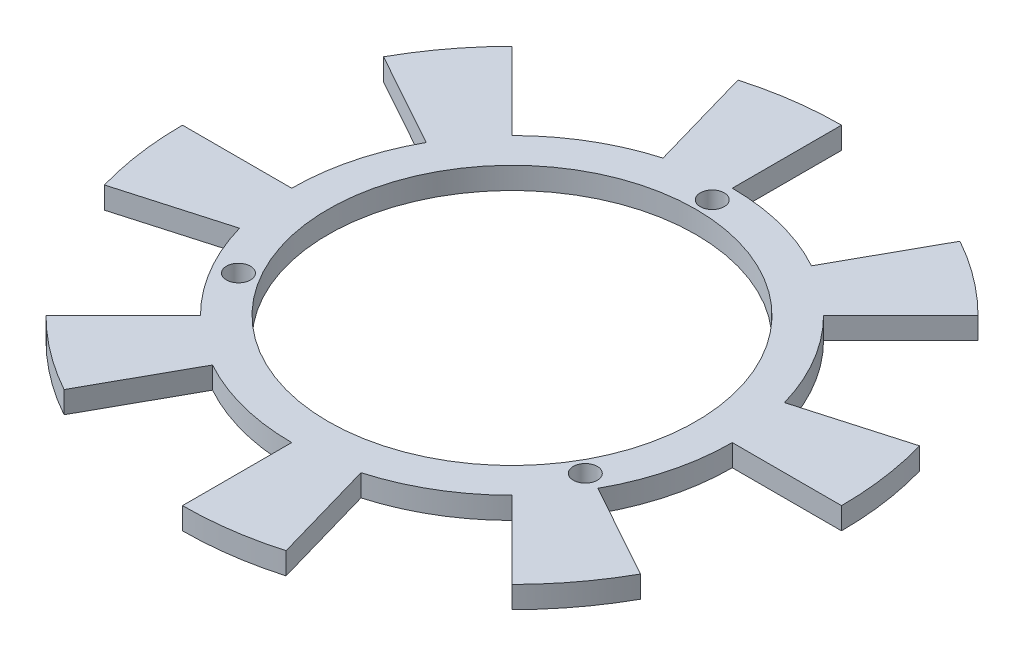
ISO-10303-21;
HEADER;
FILE_DESCRIPTION(('STEP AP214'),'2;1');
FILE_NAME('part.step','',(''),(''),'','','');
FILE_SCHEMA(('AUTOMOTIVE_DESIGN { 1 0 10303 214 1 1 1 1 }'));
ENDSEC;
DATA;
#1=APPLICATION_CONTEXT('core data for automotive mechanical design processes');
#2=APPLICATION_PROTOCOL_DEFINITION('international standard','automotive_design',2000,#1);
#3=PRODUCT_CONTEXT('',#1,'mechanical');
#4=PRODUCT('Part','Part','',(#3));
#5=PRODUCT_RELATED_PRODUCT_CATEGORY('part','',(#4));
#6=PRODUCT_DEFINITION_FORMATION('','',#4);
#7=PRODUCT_DEFINITION_CONTEXT('part definition',#1,'design');
#8=PRODUCT_DEFINITION('design','',#6,#7);
#9=PRODUCT_DEFINITION_SHAPE('','',#8);
#10=(LENGTH_UNIT() NAMED_UNIT(*) SI_UNIT(.MILLI.,.METRE.));
#11=(NAMED_UNIT(*) PLANE_ANGLE_UNIT() SI_UNIT($,.RADIAN.));
#12=(NAMED_UNIT(*) SI_UNIT($,.STERADIAN.) SOLID_ANGLE_UNIT());
#13=UNCERTAINTY_MEASURE_WITH_UNIT(LENGTH_MEASURE(1.E-05),#10,'distance_accuracy_value','');
#14=(GEOMETRIC_REPRESENTATION_CONTEXT(3) GLOBAL_UNCERTAINTY_ASSIGNED_CONTEXT((#13)) GLOBAL_UNIT_ASSIGNED_CONTEXT((#10,
#11,#12)) REPRESENTATION_CONTEXT('',''));
#15=CARTESIAN_POINT('',(0.,0.,0.));
#16=DIRECTION('',(0.,0.,1.));
#17=DIRECTION('',(1.,0.,0.));
#18=AXIS2_PLACEMENT_3D('',#15,#16,#17);
#19=CARTESIAN_POINT('',(0.,-3.,0.));
#20=DIRECTION('',(0.,1.,0.));
#21=DIRECTION('',(0.,0.,1.));
#22=AXIS2_PLACEMENT_3D('',#19,#20,#21);
#23=CYLINDRICAL_SURFACE('',#22,30.25);
#24=DIRECTION('',(0.,-1.,0.));
#25=VECTOR('',#24,1.);
#26=CARTESIAN_POINT('',(-14.6654910124517,0.,26.4572461409667));
#27=LINE('',#26,#25);
#28=CARTESIAN_POINT('',(-14.6654910124517,0.,26.4572461409667));
#29=VERTEX_POINT('',#28);
#30=CARTESIAN_POINT('',(-14.6654910124517,-3.,26.4572461409667));
#31=VERTEX_POINT('',#30);
#32=EDGE_CURVE('E286',#29,#31,#27,.T.);
#33=ORIENTED_EDGE('',*,*,#32,.T.);
#34=CARTESIAN_POINT('',(0.,-3.,0.));
#35=DIRECTION('',(0.,1.,0.));
#36=DIRECTION('',(1.,0.,0.));
#37=AXIS2_PLACEMENT_3D('',#34,#35,#36);
#38=CIRCLE('',#37,30.25);
#39=CARTESIAN_POINT('',(0.,-3.,30.25));
#40=VERTEX_POINT('',#39);
#41=EDGE_CURVE('E51',#31,#40,#38,.T.);
#42=ORIENTED_EDGE('',*,*,#41,.T.);
#43=DIRECTION('',(0.,-1.,0.));
#44=VECTOR('',#43,1.);
#45=CARTESIAN_POINT('',(0.,0.,30.25));
#46=LINE('',#45,#44);
#47=CARTESIAN_POINT('',(0.,0.,30.25));
#48=VERTEX_POINT('',#47);
#49=EDGE_CURVE('E442',#48,#40,#46,.T.);
#50=ORIENTED_EDGE('',*,*,#49,.F.);
#51=CARTESIAN_POINT('',(0.,0.,0.));
#52=DIRECTION('',(0.,1.,0.));
#53=DIRECTION('',(1.,0.,0.));
#54=AXIS2_PLACEMENT_3D('',#51,#52,#53);
#55=CIRCLE('',#54,30.25);
#56=EDGE_CURVE('E541',#29,#48,#55,.T.);
#57=ORIENTED_EDGE('',*,*,#56,.F.);
#58=EDGE_LOOP('',(#33,#42,#50,#57));
#59=FACE_BOUND('',#58,.T.);
#60=ADVANCED_FACE('F41',(#59),#23,.T.);
#61=DIRECTION('',(0.,-1.,0.));
#62=VECTOR('',#61,1.);
#63=CARTESIAN_POINT('',(-21.3899801308925,0.,21.3899801308936));
#64=LINE('',#63,#62);
#65=CARTESIAN_POINT('',(-21.3899801308925,0.,21.3899801308936));
#66=VERTEX_POINT('',#65);
#67=CARTESIAN_POINT('',(-21.3899801308925,-3.,21.3899801308936));
#68=VERTEX_POINT('',#67);
#69=EDGE_CURVE('E265',#66,#68,#64,.T.);
#70=ORIENTED_EDGE('',*,*,#69,.F.);
#71=CARTESIAN_POINT('',(-29.0781663021341,0.,8.33803001346424));
#72=VERTEX_POINT('',#71);
#73=EDGE_CURVE('E271',#72,#66,#55,.T.);
#74=ORIENTED_EDGE('',*,*,#73,.F.);
#75=DIRECTION('',(0.,-1.,0.));
#76=VECTOR('',#75,1.);
#77=CARTESIAN_POINT('',(-29.0781663021341,0.,8.33803001346424));
#78=LINE('',#77,#76);
#79=CARTESIAN_POINT('',(-29.0781663021341,-3.,8.33803001346424));
#80=VERTEX_POINT('',#79);
#81=EDGE_CURVE('E308',#72,#80,#78,.T.);
#82=ORIENTED_EDGE('',*,*,#81,.T.);
#83=EDGE_CURVE('E612',#80,#68,#38,.T.);
#84=ORIENTED_EDGE('',*,*,#83,.T.);
#85=EDGE_LOOP('',(#70,#74,#82,#84));
#86=FACE_BOUND('',#85,.T.);
#87=ADVANCED_FACE('F516',(#86),#23,.T.);
#88=DIRECTION('',(0.,-1.,0.));
#89=VECTOR('',#88,1.);
#90=CARTESIAN_POINT('',(-30.25,0.,7.49400541621981E-13));
#91=LINE('',#90,#89);
#92=CARTESIAN_POINT('',(-30.25,0.,7.49400541621981E-13));
#93=VERTEX_POINT('',#92);
#94=CARTESIAN_POINT('',(-30.25,-3.,7.49400541621981E-13));
#95=VERTEX_POINT('',#94);
#96=EDGE_CURVE('E311',#93,#95,#91,.T.);
#97=ORIENTED_EDGE('',*,*,#96,.F.);
#98=CARTESIAN_POINT('',(-26.4572461409667,0.,-14.6654910124517));
#99=VERTEX_POINT('',#98);
#100=EDGE_CURVE('E589',#99,#93,#55,.T.);
#101=ORIENTED_EDGE('',*,*,#100,.F.);
#102=DIRECTION('',(0.,-1.,0.));
#103=VECTOR('',#102,1.);
#104=CARTESIAN_POINT('',(-26.4572461409667,0.,-14.6654910124517));
#105=LINE('',#104,#103);
#106=CARTESIAN_POINT('',(-26.4572461409667,-3.,-14.6654910124517));
#107=VERTEX_POINT('',#106);
#108=EDGE_CURVE('E334',#99,#107,#105,.T.);
#109=ORIENTED_EDGE('',*,*,#108,.T.);
#110=EDGE_CURVE('E601',#107,#95,#38,.T.);
#111=ORIENTED_EDGE('',*,*,#110,.T.);
#112=EDGE_LOOP('',(#97,#101,#109,#111));
#113=FACE_BOUND('',#112,.T.);
#114=ADVANCED_FACE('F521',(#113),#23,.T.);
#115=DIRECTION('',(0.,-1.,0.));
#116=VECTOR('',#115,1.);
#117=CARTESIAN_POINT('',(-21.3899801308936,0.,-21.3899801308926));
#118=LINE('',#117,#116);
#119=CARTESIAN_POINT('',(-21.3899801308936,0.,-21.3899801308926));
#120=VERTEX_POINT('',#119);
#121=CARTESIAN_POINT('',(-21.3899801308936,-3.,-21.3899801308926));
#122=VERTEX_POINT('',#121);
#123=EDGE_CURVE('E337',#120,#122,#118,.T.);
#124=ORIENTED_EDGE('',*,*,#123,.F.);
#125=CARTESIAN_POINT('',(-8.33803001346424,0.,-29.0781663021341));
#126=VERTEX_POINT('',#125);
#127=EDGE_CURVE('E587',#126,#120,#55,.T.);
#128=ORIENTED_EDGE('',*,*,#127,.F.);
#129=DIRECTION('',(0.,-1.,0.));
#130=VECTOR('',#129,1.);
#131=CARTESIAN_POINT('',(-8.33803001346424,0.,-29.0781663021341));
#132=LINE('',#131,#130);
#133=CARTESIAN_POINT('',(-8.33803001346424,-3.,-29.0781663021341));
#134=VERTEX_POINT('',#133);
#135=EDGE_CURVE('E360',#126,#134,#132,.T.);
#136=ORIENTED_EDGE('',*,*,#135,.T.);
#137=EDGE_CURVE('E865',#134,#122,#38,.T.);
#138=ORIENTED_EDGE('',*,*,#137,.T.);
#139=EDGE_LOOP('',(#124,#128,#136,#138));
#140=FACE_BOUND('',#139,.T.);
#141=ADVANCED_FACE('F864',(#140),#23,.T.);
#142=DIRECTION('',(0.,-1.,0.));
#143=VECTOR('',#142,1.);
#144=CARTESIAN_POINT('',(-6.27102536565616E-13,0.,-30.25));
#145=LINE('',#144,#143);
#146=CARTESIAN_POINT('',(-6.27102536565616E-13,0.,-30.25));
#147=VERTEX_POINT('',#146);
#148=CARTESIAN_POINT('',(-6.27102536565616E-13,-3.,-30.25));
#149=VERTEX_POINT('',#148);
#150=EDGE_CURVE('E363',#147,#149,#145,.T.);
#151=ORIENTED_EDGE('',*,*,#150,.F.);
#152=CARTESIAN_POINT('',(14.6654910124517,0.,-26.4572461409667));
#153=VERTEX_POINT('',#152);
#154=EDGE_CURVE('E543',#153,#147,#55,.T.);
#155=ORIENTED_EDGE('',*,*,#154,.F.);
#156=DIRECTION('',(0.,-1.,0.));
#157=VECTOR('',#156,1.);
#158=CARTESIAN_POINT('',(14.6654910124517,0.,-26.4572461409667));
#159=LINE('',#158,#157);
#160=CARTESIAN_POINT('',(14.6654910124517,-3.,-26.4572461409667));
#161=VERTEX_POINT('',#160);
#162=EDGE_CURVE('E386',#153,#161,#159,.T.);
#163=ORIENTED_EDGE('',*,*,#162,.T.);
#164=EDGE_CURVE('E867',#161,#149,#38,.T.);
#165=ORIENTED_EDGE('',*,*,#164,.T.);
#166=EDGE_LOOP('',(#151,#155,#163,#165));
#167=FACE_BOUND('',#166,.T.);
#168=ADVANCED_FACE('F872',(#167),#23,.T.);
#169=DIRECTION('',(0.,-1.,0.));
#170=VECTOR('',#169,1.);
#171=CARTESIAN_POINT('',(21.3899801308927,0.,-21.3899801308935));
#172=LINE('',#171,#170);
#173=CARTESIAN_POINT('',(21.3899801308927,0.,-21.3899801308935));
#174=VERTEX_POINT('',#173);
#175=CARTESIAN_POINT('',(21.3899801308927,-3.,-21.3899801308935));
#176=VERTEX_POINT('',#175);
#177=EDGE_CURVE('E389',#174,#176,#172,.T.);
#178=ORIENTED_EDGE('',*,*,#177,.F.);
#179=CARTESIAN_POINT('',(29.0781663021341,0.,-8.33803001346424));
#180=VERTEX_POINT('',#179);
#181=EDGE_CURVE('E540',#180,#174,#55,.T.);
#182=ORIENTED_EDGE('',*,*,#181,.F.);
#183=DIRECTION('',(0.,-1.,0.));
#184=VECTOR('',#183,1.);
#185=CARTESIAN_POINT('',(29.0781663021342,0.,-8.33803001346425));
#186=LINE('',#185,#184);
#187=CARTESIAN_POINT('',(29.0781663021342,-3.,-8.33803001346425));
#188=VERTEX_POINT('',#187);
#189=EDGE_CURVE('E412',#180,#188,#186,.T.);
#190=ORIENTED_EDGE('',*,*,#189,.T.);
#191=EDGE_CURVE('E50',#188,#176,#38,.T.);
#192=ORIENTED_EDGE('',*,*,#191,.T.);
#193=EDGE_LOOP('',(#178,#182,#190,#192));
#194=FACE_BOUND('',#193,.T.);
#195=ADVANCED_FACE('F529',(#194),#23,.T.);
#196=DIRECTION('',(0.,-1.,0.));
#197=VECTOR('',#196,1.);
#198=CARTESIAN_POINT('',(8.33803001346424,0.,29.0781663021341));
#199=LINE('',#198,#197);
#200=CARTESIAN_POINT('',(8.33803001346424,0.,29.0781663021341));
#201=VERTEX_POINT('',#200);
#202=CARTESIAN_POINT('',(8.33803001346424,-3.,29.0781663021341));
#203=VERTEX_POINT('',#202);
#204=EDGE_CURVE('E439',#201,#203,#199,.T.);
#205=ORIENTED_EDGE('',*,*,#204,.T.);
#206=CARTESIAN_POINT('',(21.3899801308934,-3.,21.3899801308927));
#207=VERTEX_POINT('',#206);
#208=EDGE_CURVE('E52',#203,#207,#38,.T.);
#209=ORIENTED_EDGE('',*,*,#208,.T.);
#210=DIRECTION('',(0.,-1.,0.));
#211=VECTOR('',#210,1.);
#212=CARTESIAN_POINT('',(21.3899801308934,0.,21.3899801308927));
#213=LINE('',#212,#211);
#214=CARTESIAN_POINT('',(21.3899801308934,0.,21.3899801308927));
#215=VERTEX_POINT('',#214);
#216=EDGE_CURVE('E470',#215,#207,#213,.T.);
#217=ORIENTED_EDGE('',*,*,#216,.F.);
#218=EDGE_CURVE('E495',#201,#215,#55,.T.);
#219=ORIENTED_EDGE('',*,*,#218,.F.);
#220=EDGE_LOOP('',(#205,#209,#217,#219));
#221=FACE_BOUND('',#220,.T.);
#222=ADVANCED_FACE('F524',(#221),#23,.T.);
#223=DIRECTION('',(0.,-1.,0.));
#224=VECTOR('',#223,1.);
#225=CARTESIAN_POINT('',(30.25,0.,-5.29090660172926E-13));
#226=LINE('',#225,#224);
#227=CARTESIAN_POINT('',(30.25,0.,-5.29090660172926E-13));
#228=VERTEX_POINT('',#227);
#229=CARTESIAN_POINT('',(30.25,-3.,-5.29090660172926E-13));
#230=VERTEX_POINT('',#229);
#231=EDGE_CURVE('E415',#228,#230,#226,.T.);
#232=ORIENTED_EDGE('',*,*,#231,.F.);
#233=CARTESIAN_POINT('',(26.4572461409667,0.,14.6654910124517));
#234=VERTEX_POINT('',#233);
#235=EDGE_CURVE('E45',#234,#228,#55,.T.);
#236=ORIENTED_EDGE('',*,*,#235,.F.);
#237=DIRECTION('',(0.,-1.,0.));
#238=VECTOR('',#237,1.);
#239=CARTESIAN_POINT('',(26.4572461409667,0.,14.6654910124517));
#240=LINE('',#239,#238);
#241=CARTESIAN_POINT('',(26.4572461409667,-3.,14.6654910124517));
#242=VERTEX_POINT('',#241);
#243=EDGE_CURVE('E467',#234,#242,#240,.T.);
#244=ORIENTED_EDGE('',*,*,#243,.T.);
#245=EDGE_CURVE('E12',#242,#230,#38,.T.);
#246=ORIENTED_EDGE('',*,*,#245,.T.);
#247=EDGE_LOOP('',(#232,#236,#244,#246));
#248=FACE_BOUND('',#247,.T.);
#249=ADVANCED_FACE('F43',(#248),#23,.T.);
#250=CARTESIAN_POINT('',(0.,-3.,0.));
#251=DIRECTION('',(0.,1.,0.));
#252=DIRECTION('',(0.,0.,1.));
#253=AXIS2_PLACEMENT_3D('',#250,#251,#252);
#254=PLANE('',#253);
#255=CARTESIAN_POINT('',(0.,-3.,-27.5));
#256=DIRECTION('',(0.,1.,0.));
#257=DIRECTION('',(0.,0.,1.));
#258=AXIS2_PLACEMENT_3D('',#255,#256,#257);
#259=CIRCLE('',#258,1.65);
#260=CARTESIAN_POINT('',(0.,-3.,-25.85));
#261=VERTEX_POINT('',#260);
#262=EDGE_CURVE('E488',#261,#261,#259,.T.);
#263=ORIENTED_EDGE('',*,*,#262,.T.);
#264=EDGE_LOOP('',(#263));
#265=FACE_BOUND('',#264,.T.);
#266=CARTESIAN_POINT('',(23.815698604072,-3.,13.7500000000001));
#267=DIRECTION('',(0.,1.,0.));
#268=DIRECTION('',(0.,0.,1.));
#269=AXIS2_PLACEMENT_3D('',#266,#267,#268);
#270=CIRCLE('',#269,1.65);
#271=CARTESIAN_POINT('',(23.815698604072,-3.,15.4000000000001));
#272=VERTEX_POINT('',#271);
#273=EDGE_CURVE('E485',#272,#272,#270,.T.);
#274=ORIENTED_EDGE('',*,*,#273,.T.);
#275=EDGE_LOOP('',(#274));
#276=FACE_BOUND('',#275,.T.);
#277=CARTESIAN_POINT('',(-23.815698604072,-3.,13.7500000000001));
#278=DIRECTION('',(0.,1.,0.));
#279=DIRECTION('',(0.,0.,1.));
#280=AXIS2_PLACEMENT_3D('',#277,#278,#279);
#281=CIRCLE('',#280,1.65);
#282=CARTESIAN_POINT('',(-23.815698604072,-3.,15.4000000000001));
#283=VERTEX_POINT('',#282);
#284=EDGE_CURVE('E477',#283,#283,#281,.T.);
#285=ORIENTED_EDGE('',*,*,#284,.T.);
#286=EDGE_LOOP('',(#285));
#287=FACE_BOUND('',#286,.T.);
#288=CARTESIAN_POINT('',(0.,-3.,0.));
#289=DIRECTION('',(0.,1.,0.));
#290=DIRECTION('',(0.,0.,1.));
#291=AXIS2_PLACEMENT_3D('',#288,#289,#290);
#292=CIRCLE('',#291,25.25);
#293=CARTESIAN_POINT('',(0.,-3.,25.25));
#294=VERTEX_POINT('',#293);
#295=EDGE_CURVE('E492',#294,#294,#292,.T.);
#296=ORIENTED_EDGE('',*,*,#295,.T.);
#297=EDGE_LOOP('',(#296));
#298=FACE_BOUND('',#297,.T.);
#299=ORIENTED_EDGE('',*,*,#245,.F.);
#300=DIRECTION('',(0.874619707139396,0.,0.484809620246336));
#301=VECTOR('',#300,1.);
#302=CARTESIAN_POINT('',(26.4572461409667,-3.,14.6654910124517));
#303=LINE('',#302,#301);
#304=CARTESIAN_POINT('',(39.5765417480577,-3.,21.9376353161467));
#305=VERTEX_POINT('',#304);
#306=EDGE_CURVE('E450',#242,#305,#303,.T.);
#307=ORIENTED_EDGE('',*,*,#306,.T.);
#308=CARTESIAN_POINT('',(0.,-3.,0.));
#309=DIRECTION('',(0.,-1.,0.));
#310=DIRECTION('',(0.,0.,-1.));
#311=AXIS2_PLACEMENT_3D('',#308,#309,#310);
#312=CIRCLE('',#311,45.25);
#313=CARTESIAN_POINT('',(31.9965818486913,-3.,31.9965818486913));
#314=VERTEX_POINT('',#313);
#315=EDGE_CURVE('E438',#305,#314,#312,.T.);
#316=ORIENTED_EDGE('',*,*,#315,.T.);
#317=DIRECTION('',(-0.707106781186525,0.,-0.70710678118657));
#318=VECTOR('',#317,1.);
#319=CARTESIAN_POINT('',(31.9965818486913,-3.,31.9965818486913));
#320=LINE('',#319,#318);
#321=EDGE_CURVE('E459',#314,#207,#320,.T.);
#322=ORIENTED_EDGE('',*,*,#321,.T.);
#323=ORIENTED_EDGE('',*,*,#208,.F.);
#324=DIRECTION('',(0.275637355817,0.,0.961261695938319));
#325=VECTOR('',#324,1.);
#326=CARTESIAN_POINT('',(8.33803001346425,-3.,29.0781663021341));
#327=LINE('',#326,#325);
#328=CARTESIAN_POINT('',(12.4725903507192,-3.,43.4970917412089));
#329=VERTEX_POINT('',#328);
#330=EDGE_CURVE('E422',#203,#329,#327,.T.);
#331=ORIENTED_EDGE('',*,*,#330,.T.);
#332=CARTESIAN_POINT('',(0.,-3.,0.));
#333=DIRECTION('',(0.,-1.,0.));
#334=DIRECTION('',(0.,0.,-1.));
#335=AXIS2_PLACEMENT_3D('',#332,#333,#334);
#336=CIRCLE('',#335,45.25);
#337=CARTESIAN_POINT('',(0.,-3.,45.25));
#338=VERTEX_POINT('',#337);
#339=EDGE_CURVE('E411',#329,#338,#336,.T.);
#340=ORIENTED_EDGE('',*,*,#339,.T.);
#341=DIRECTION('',(0.,0.,-1.));
#342=VECTOR('',#341,1.);
#343=CARTESIAN_POINT('',(0.,-3.,45.25));
#344=LINE('',#343,#342);
#345=EDGE_CURVE('E431',#338,#40,#344,.T.);
#346=ORIENTED_EDGE('',*,*,#345,.T.);
#347=ORIENTED_EDGE('',*,*,#41,.F.);
#348=DIRECTION('',(-0.484809620246337,0.,0.874619707139396));
#349=VECTOR('',#348,1.);
#350=CARTESIAN_POINT('',(-14.6654910124517,-3.,26.4572461409667));
#351=LINE('',#350,#349);
#352=CARTESIAN_POINT('',(-21.9376353161467,-3.,39.5765417480577));
#353=VERTEX_POINT('',#352);
#354=EDGE_CURVE('E275',#31,#353,#351,.T.);
#355=ORIENTED_EDGE('',*,*,#354,.T.);
#356=CARTESIAN_POINT('',(0.,-3.,0.));
#357=DIRECTION('',(0.,-1.,0.));
#358=DIRECTION('',(0.,0.,-1.));
#359=AXIS2_PLACEMENT_3D('',#356,#357,#358);
#360=CIRCLE('',#359,45.25);
#361=CARTESIAN_POINT('',(-31.9965818486913,-3.,31.9965818486913));
#362=VERTEX_POINT('',#361);
#363=EDGE_CURVE('E281',#353,#362,#360,.T.);
#364=ORIENTED_EDGE('',*,*,#363,.T.);
#365=DIRECTION('',(0.707106781186585,0.,-0.70710678118651));
#366=VECTOR('',#365,1.);
#367=CARTESIAN_POINT('',(-31.9965818486913,-3.,31.9965818486913));
#368=LINE('',#367,#366);
#369=EDGE_CURVE('E260',#362,#68,#368,.T.);
#370=ORIENTED_EDGE('',*,*,#369,.T.);
#371=ORIENTED_EDGE('',*,*,#83,.F.);
#372=DIRECTION('',(-0.961261695938319,0.,0.275637355817));
#373=VECTOR('',#372,1.);
#374=CARTESIAN_POINT('',(-29.0781663021341,-3.,8.33803001346424));
#375=LINE('',#374,#373);
#376=CARTESIAN_POINT('',(-43.4970917412089,-3.,12.4725903507192));
#377=VERTEX_POINT('',#376);
#378=EDGE_CURVE('E294',#80,#377,#375,.T.);
#379=ORIENTED_EDGE('',*,*,#378,.T.);
#380=CARTESIAN_POINT('',(0.,-3.,0.));
#381=DIRECTION('',(0.,-1.,0.));
#382=DIRECTION('',(0.,0.,-1.));
#383=AXIS2_PLACEMENT_3D('',#380,#381,#382);
#384=CIRCLE('',#383,45.25);
#385=CARTESIAN_POINT('',(-45.25,-3.,0.));
#386=VERTEX_POINT('',#385);
#387=EDGE_CURVE('E285',#377,#386,#384,.T.);
#388=ORIENTED_EDGE('',*,*,#387,.T.);
#389=DIRECTION('',(1.,0.,0.));
#390=VECTOR('',#389,1.);
#391=CARTESIAN_POINT('',(-45.25,-3.,0.));
#392=LINE('',#391,#390);
#393=EDGE_CURVE('E300',#386,#95,#392,.T.);
#394=ORIENTED_EDGE('',*,*,#393,.T.);
#395=ORIENTED_EDGE('',*,*,#110,.F.);
#396=DIRECTION('',(-0.874619707139396,0.,-0.484809620246337));
#397=VECTOR('',#396,1.);
#398=CARTESIAN_POINT('',(-26.4572461409667,-3.,-14.6654910124517));
#399=LINE('',#398,#397);
#400=CARTESIAN_POINT('',(-39.5765417480577,-3.,-21.9376353161467));
#401=VERTEX_POINT('',#400);
#402=EDGE_CURVE('E318',#107,#401,#399,.T.);
#403=ORIENTED_EDGE('',*,*,#402,.T.);
#404=CARTESIAN_POINT('',(0.,-3.,0.));
#405=DIRECTION('',(0.,-1.,0.));
#406=DIRECTION('',(0.,0.,-1.));
#407=AXIS2_PLACEMENT_3D('',#404,#405,#406);
#408=CIRCLE('',#407,45.25);
#409=CARTESIAN_POINT('',(-31.9965818486913,-3.,-31.9965818486913));
#410=VERTEX_POINT('',#409);
#411=EDGE_CURVE('E307',#401,#410,#408,.T.);
#412=ORIENTED_EDGE('',*,*,#411,.T.);
#413=DIRECTION('',(0.707106781186515,0.,0.70710678118658));
#414=VECTOR('',#413,1.);
#415=CARTESIAN_POINT('',(-31.9965818486913,-3.,-31.9965818486913));
#416=LINE('',#415,#414);
#417=EDGE_CURVE('E326',#410,#122,#416,.T.);
#418=ORIENTED_EDGE('',*,*,#417,.T.);
#419=ORIENTED_EDGE('',*,*,#137,.F.);
#420=DIRECTION('',(-0.275637355817,0.,-0.961261695938319));
#421=VECTOR('',#420,1.);
#422=CARTESIAN_POINT('',(-8.33803001346424,-3.,-29.0781663021341));
#423=LINE('',#422,#421);
#424=CARTESIAN_POINT('',(-12.4725903507192,-3.,-43.4970917412089));
#425=VERTEX_POINT('',#424);
#426=EDGE_CURVE('E344',#134,#425,#423,.T.);
#427=ORIENTED_EDGE('',*,*,#426,.T.);
#428=CARTESIAN_POINT('',(0.,-3.,0.));
#429=DIRECTION('',(0.,-1.,0.));
#430=DIRECTION('',(0.,0.,-1.));
#431=AXIS2_PLACEMENT_3D('',#428,#429,#430);
#432=CIRCLE('',#431,45.25);
#433=CARTESIAN_POINT('',(0.,-3.,-45.25));
#434=VERTEX_POINT('',#433);
#435=EDGE_CURVE('E333',#425,#434,#432,.T.);
#436=ORIENTED_EDGE('',*,*,#435,.T.);
#437=DIRECTION('',(0.,0.,1.));
#438=VECTOR('',#437,1.);
#439=CARTESIAN_POINT('',(0.,-3.,-45.25));
#440=LINE('',#439,#438);
#441=EDGE_CURVE('E352',#434,#149,#440,.T.);
#442=ORIENTED_EDGE('',*,*,#441,.T.);
#443=ORIENTED_EDGE('',*,*,#164,.F.);
#444=DIRECTION('',(0.484809620246336,0.,-0.874619707139396));
#445=VECTOR('',#444,1.);
#446=CARTESIAN_POINT('',(14.6654910124517,-3.,-26.4572461409667));
#447=LINE('',#446,#445);
#448=CARTESIAN_POINT('',(21.9376353161467,-3.,-39.5765417480577));
#449=VERTEX_POINT('',#448);
#450=EDGE_CURVE('E370',#161,#449,#447,.T.);
#451=ORIENTED_EDGE('',*,*,#450,.T.);
#452=CARTESIAN_POINT('',(0.,-3.,0.));
#453=DIRECTION('',(0.,-1.,0.));
#454=DIRECTION('',(0.,0.,-1.));
#455=AXIS2_PLACEMENT_3D('',#452,#453,#454);
#456=CIRCLE('',#455,45.25);
#457=CARTESIAN_POINT('',(31.9965818486913,-3.,-31.9965818486913));
#458=VERTEX_POINT('',#457);
#459=EDGE_CURVE('E359',#449,#458,#456,.T.);
#460=ORIENTED_EDGE('',*,*,#459,.T.);
#461=DIRECTION('',(-0.707106781186574,0.,0.707106781186521));
#462=VECTOR('',#461,1.);
#463=CARTESIAN_POINT('',(31.9965818486913,-3.,-31.9965818486913));
#464=LINE('',#463,#462);
#465=EDGE_CURVE('E378',#458,#176,#464,.T.);
#466=ORIENTED_EDGE('',*,*,#465,.T.);
#467=ORIENTED_EDGE('',*,*,#191,.F.);
#468=DIRECTION('',(0.961261695938319,0.,-0.275637355817));
#469=VECTOR('',#468,1.);
#470=CARTESIAN_POINT('',(29.0781663021341,-3.,-8.33803001346424));
#471=LINE('',#470,#469);
#472=CARTESIAN_POINT('',(43.4970917412089,-3.,-12.4725903507192));
#473=VERTEX_POINT('',#472);
#474=EDGE_CURVE('E396',#188,#473,#471,.T.);
#475=ORIENTED_EDGE('',*,*,#474,.T.);
#476=CARTESIAN_POINT('',(0.,-3.,0.));
#477=DIRECTION('',(0.,-1.,0.));
#478=DIRECTION('',(0.,0.,-1.));
#479=AXIS2_PLACEMENT_3D('',#476,#477,#478);
#480=CIRCLE('',#479,45.25);
#481=CARTESIAN_POINT('',(45.25,-3.,0.));
#482=VERTEX_POINT('',#481);
#483=EDGE_CURVE('E385',#473,#482,#480,.T.);
#484=ORIENTED_EDGE('',*,*,#483,.T.);
#485=DIRECTION('',(-1.,0.,0.));
#486=VECTOR('',#485,1.);
#487=CARTESIAN_POINT('',(45.25,-3.,0.));
#488=LINE('',#487,#486);
#489=EDGE_CURVE('E404',#482,#230,#488,.T.);
#490=ORIENTED_EDGE('',*,*,#489,.T.);
#491=EDGE_LOOP('',(#299,#307,#316,#322,#323,#331,#340,#346,#347,#355,#364,#370,#371,#379,#388,
#394,#395,#403,#412,#418,#419,#427,#436,#442,#443,#451,#460,#466,#467,#475,#484,#490));
#492=FACE_BOUND('',#491,.T.);
#493=ADVANCED_FACE('F502',(#265,#276,#287,#298,#492),#254,.F.);
#494=CARTESIAN_POINT('',(0.,0.,0.));
#495=DIRECTION('',(0.,1.,0.));
#496=DIRECTION('',(0.,0.,1.));
#497=AXIS2_PLACEMENT_3D('',#494,#495,#496);
#498=PLANE('',#497);
#499=CARTESIAN_POINT('',(0.,0.,-27.5));
#500=DIRECTION('',(0.,1.,0.));
#501=DIRECTION('',(0.,0.,1.));
#502=AXIS2_PLACEMENT_3D('',#499,#500,#501);
#503=CIRCLE('',#502,1.65);
#504=CARTESIAN_POINT('',(0.,0.,-25.85));
#505=VERTEX_POINT('',#504);
#506=EDGE_CURVE('E474',#505,#505,#503,.T.);
#507=ORIENTED_EDGE('',*,*,#506,.F.);
#508=EDGE_LOOP('',(#507));
#509=FACE_BOUND('',#508,.T.);
#510=CARTESIAN_POINT('',(23.815698604072,0.,13.7500000000001));
#511=DIRECTION('',(0.,1.,0.));
#512=DIRECTION('',(0.,0.,1.));
#513=AXIS2_PLACEMENT_3D('',#510,#511,#512);
#514=CIRCLE('',#513,1.65);
#515=CARTESIAN_POINT('',(23.815698604072,0.,15.4000000000001));
#516=VERTEX_POINT('',#515);
#517=EDGE_CURVE('E478',#516,#516,#514,.T.);
#518=ORIENTED_EDGE('',*,*,#517,.F.);
#519=EDGE_LOOP('',(#518));
#520=FACE_BOUND('',#519,.T.);
#521=CARTESIAN_POINT('',(-23.815698604072,0.,13.7500000000001));
#522=DIRECTION('',(0.,1.,0.));
#523=DIRECTION('',(0.,0.,1.));
#524=AXIS2_PLACEMENT_3D('',#521,#522,#523);
#525=CIRCLE('',#524,1.65);
#526=CARTESIAN_POINT('',(-23.815698604072,0.,15.4000000000001));
#527=VERTEX_POINT('',#526);
#528=EDGE_CURVE('E466',#527,#527,#525,.T.);
#529=ORIENTED_EDGE('',*,*,#528,.F.);
#530=EDGE_LOOP('',(#529));
#531=FACE_BOUND('',#530,.T.);
#532=CARTESIAN_POINT('',(0.,0.,0.));
#533=DIRECTION('',(0.,1.,0.));
#534=DIRECTION('',(0.,0.,1.));
#535=AXIS2_PLACEMENT_3D('',#532,#533,#534);
#536=CIRCLE('',#535,25.25);
#537=CARTESIAN_POINT('',(0.,0.,25.25));
#538=VERTEX_POINT('',#537);
#539=EDGE_CURVE('E491',#538,#538,#536,.T.);
#540=ORIENTED_EDGE('',*,*,#539,.F.);
#541=EDGE_LOOP('',(#540));
#542=FACE_BOUND('',#541,.T.);
#543=ORIENTED_EDGE('',*,*,#235,.T.);
#544=DIRECTION('',(-1.,0.,0.));
#545=VECTOR('',#544,1.);
#546=CARTESIAN_POINT('',(45.25,0.,0.));
#547=LINE('',#546,#545);
#548=CARTESIAN_POINT('',(45.25,0.,0.));
#549=VERTEX_POINT('',#548);
#550=EDGE_CURVE('E395',#549,#228,#547,.T.);
#551=ORIENTED_EDGE('',*,*,#550,.F.);
#552=CARTESIAN_POINT('',(0.,0.,0.));
#553=DIRECTION('',(0.,-1.,0.));
#554=DIRECTION('',(0.,0.,-1.));
#555=AXIS2_PLACEMENT_3D('',#552,#553,#554);
#556=CIRCLE('',#555,45.25);
#557=CARTESIAN_POINT('',(43.4970917412089,0.,-12.4725903507192));
#558=VERTEX_POINT('',#557);
#559=EDGE_CURVE('E392',#558,#549,#556,.T.);
#560=ORIENTED_EDGE('',*,*,#559,.F.);
#561=DIRECTION('',(0.961261695938319,0.,-0.275637355817));
#562=VECTOR('',#561,1.);
#563=CARTESIAN_POINT('',(29.0781663021341,0.,-8.33803001346424));
#564=LINE('',#563,#562);
#565=EDGE_CURVE('E398',#180,#558,#564,.T.);
#566=ORIENTED_EDGE('',*,*,#565,.F.);
#567=ORIENTED_EDGE('',*,*,#181,.T.);
#568=DIRECTION('',(-0.707106781186574,0.,0.707106781186521));
#569=VECTOR('',#568,1.);
#570=CARTESIAN_POINT('',(31.9965818486913,0.,-31.9965818486913));
#571=LINE('',#570,#569);
#572=CARTESIAN_POINT('',(31.9965818486913,0.,-31.9965818486913));
#573=VERTEX_POINT('',#572);
#574=EDGE_CURVE('E369',#573,#174,#571,.T.);
#575=ORIENTED_EDGE('',*,*,#574,.F.);
#576=CARTESIAN_POINT('',(0.,0.,0.));
#577=DIRECTION('',(0.,-1.,0.));
#578=DIRECTION('',(0.,0.,-1.));
#579=AXIS2_PLACEMENT_3D('',#576,#577,#578);
#580=CIRCLE('',#579,45.25);
#581=CARTESIAN_POINT('',(21.9376353161467,0.,-39.5765417480577));
#582=VERTEX_POINT('',#581);
#583=EDGE_CURVE('E366',#582,#573,#580,.T.);
#584=ORIENTED_EDGE('',*,*,#583,.F.);
#585=DIRECTION('',(0.484809620246336,0.,-0.874619707139396));
#586=VECTOR('',#585,1.);
#587=CARTESIAN_POINT('',(14.6654910124517,0.,-26.4572461409667));
#588=LINE('',#587,#586);
#589=EDGE_CURVE('E372',#153,#582,#588,.T.);
#590=ORIENTED_EDGE('',*,*,#589,.F.);
#591=ORIENTED_EDGE('',*,*,#154,.T.);
#592=DIRECTION('',(0.,0.,1.));
#593=VECTOR('',#592,1.);
#594=CARTESIAN_POINT('',(0.,0.,-45.25));
#595=LINE('',#594,#593);
#596=CARTESIAN_POINT('',(0.,0.,-45.25));
#597=VERTEX_POINT('',#596);
#598=EDGE_CURVE('E343',#597,#147,#595,.T.);
#599=ORIENTED_EDGE('',*,*,#598,.F.);
#600=CARTESIAN_POINT('',(0.,0.,0.));
#601=DIRECTION('',(0.,-1.,0.));
#602=DIRECTION('',(0.,0.,-1.));
#603=AXIS2_PLACEMENT_3D('',#600,#601,#602);
#604=CIRCLE('',#603,45.25);
#605=CARTESIAN_POINT('',(-12.4725903507192,0.,-43.4970917412089));
#606=VERTEX_POINT('',#605);
#607=EDGE_CURVE('E340',#606,#597,#604,.T.);
#608=ORIENTED_EDGE('',*,*,#607,.F.);
#609=DIRECTION('',(-0.275637355817,0.,-0.961261695938319));
#610=VECTOR('',#609,1.);
#611=CARTESIAN_POINT('',(-8.33803001346424,0.,-29.0781663021341));
#612=LINE('',#611,#610);
#613=EDGE_CURVE('E346',#126,#606,#612,.T.);
#614=ORIENTED_EDGE('',*,*,#613,.F.);
#615=ORIENTED_EDGE('',*,*,#127,.T.);
#616=DIRECTION('',(0.707106781186515,0.,0.70710678118658));
#617=VECTOR('',#616,1.);
#618=CARTESIAN_POINT('',(-31.9965818486913,0.,-31.9965818486913));
#619=LINE('',#618,#617);
#620=CARTESIAN_POINT('',(-31.9965818486913,0.,-31.9965818486913));
#621=VERTEX_POINT('',#620);
#622=EDGE_CURVE('E317',#621,#120,#619,.T.);
#623=ORIENTED_EDGE('',*,*,#622,.F.);
#624=CARTESIAN_POINT('',(0.,0.,0.));
#625=DIRECTION('',(0.,-1.,0.));
#626=DIRECTION('',(0.,0.,-1.));
#627=AXIS2_PLACEMENT_3D('',#624,#625,#626);
#628=CIRCLE('',#627,45.25);
#629=CARTESIAN_POINT('',(-39.5765417480577,0.,-21.9376353161467));
#630=VERTEX_POINT('',#629);
#631=EDGE_CURVE('E314',#630,#621,#628,.T.);
#632=ORIENTED_EDGE('',*,*,#631,.F.);
#633=DIRECTION('',(-0.874619707139396,0.,-0.484809620246337));
#634=VECTOR('',#633,1.);
#635=CARTESIAN_POINT('',(-26.4572461409667,0.,-14.6654910124517));
#636=LINE('',#635,#634);
#637=EDGE_CURVE('E320',#99,#630,#636,.T.);
#638=ORIENTED_EDGE('',*,*,#637,.F.);
#639=ORIENTED_EDGE('',*,*,#100,.T.);
#640=DIRECTION('',(1.,0.,0.));
#641=VECTOR('',#640,1.);
#642=CARTESIAN_POINT('',(-45.25,0.,0.));
#643=LINE('',#642,#641);
#644=CARTESIAN_POINT('',(-45.25,0.,0.));
#645=VERTEX_POINT('',#644);
#646=EDGE_CURVE('E293',#645,#93,#643,.T.);
#647=ORIENTED_EDGE('',*,*,#646,.F.);
#648=CARTESIAN_POINT('',(0.,0.,0.));
#649=DIRECTION('',(0.,-1.,0.));
#650=DIRECTION('',(0.,0.,-1.));
#651=AXIS2_PLACEMENT_3D('',#648,#649,#650);
#652=CIRCLE('',#651,45.25);
#653=CARTESIAN_POINT('',(-43.4970917412089,0.,12.4725903507192));
#654=VERTEX_POINT('',#653);
#655=EDGE_CURVE('E290',#654,#645,#652,.T.);
#656=ORIENTED_EDGE('',*,*,#655,.F.);
#657=DIRECTION('',(-0.961261695938319,0.,0.275637355817));
#658=VECTOR('',#657,1.);
#659=CARTESIAN_POINT('',(-29.0781663021341,0.,8.33803001346424));
#660=LINE('',#659,#658);
#661=EDGE_CURVE('E66',#72,#654,#660,.T.);
#662=ORIENTED_EDGE('',*,*,#661,.F.);
#663=ORIENTED_EDGE('',*,*,#73,.T.);
#664=DIRECTION('',(0.707106781186585,0.,-0.70710678118651));
#665=VECTOR('',#664,1.);
#666=CARTESIAN_POINT('',(-31.9965818486913,0.,31.9965818486913));
#667=LINE('',#666,#665);
#668=CARTESIAN_POINT('',(-31.9965818486913,0.,31.9965818486913));
#669=VERTEX_POINT('',#668);
#670=EDGE_CURVE('E257',#669,#66,#667,.T.);
#671=ORIENTED_EDGE('',*,*,#670,.F.);
#672=CARTESIAN_POINT('',(0.,0.,0.));
#673=DIRECTION('',(0.,-1.,0.));
#674=DIRECTION('',(0.,0.,-1.));
#675=AXIS2_PLACEMENT_3D('',#672,#673,#674);
#676=CIRCLE('',#675,45.25);
#677=CARTESIAN_POINT('',(-21.9376353161467,0.,39.5765417480577));
#678=VERTEX_POINT('',#677);
#679=EDGE_CURVE('E269',#678,#669,#676,.T.);
#680=ORIENTED_EDGE('',*,*,#679,.F.);
#681=DIRECTION('',(-0.484809620246337,0.,0.874619707139396));
#682=VECTOR('',#681,1.);
#683=CARTESIAN_POINT('',(-14.6654910124517,0.,26.4572461409667));
#684=LINE('',#683,#682);
#685=EDGE_CURVE('E59',#29,#678,#684,.T.);
#686=ORIENTED_EDGE('',*,*,#685,.F.);
#687=ORIENTED_EDGE('',*,*,#56,.T.);
#688=DIRECTION('',(0.,0.,-1.));
#689=VECTOR('',#688,1.);
#690=CARTESIAN_POINT('',(0.,0.,45.25));
#691=LINE('',#690,#689);
#692=CARTESIAN_POINT('',(0.,0.,45.25));
#693=VERTEX_POINT('',#692);
#694=EDGE_CURVE('E421',#693,#48,#691,.T.);
#695=ORIENTED_EDGE('',*,*,#694,.F.);
#696=CARTESIAN_POINT('',(0.,0.,0.));
#697=DIRECTION('',(0.,-1.,0.));
#698=DIRECTION('',(0.,0.,-1.));
#699=AXIS2_PLACEMENT_3D('',#696,#697,#698);
#700=CIRCLE('',#699,45.25);
#701=CARTESIAN_POINT('',(12.4725903507192,0.,43.4970917412089));
#702=VERTEX_POINT('',#701);
#703=EDGE_CURVE('E418',#702,#693,#700,.T.);
#704=ORIENTED_EDGE('',*,*,#703,.F.);
#705=DIRECTION('',(0.275637355817,0.,0.961261695938319));
#706=VECTOR('',#705,1.);
#707=CARTESIAN_POINT('',(8.33803001346425,0.,29.0781663021341));
#708=LINE('',#707,#706);
#709=EDGE_CURVE('E425',#201,#702,#708,.T.);
#710=ORIENTED_EDGE('',*,*,#709,.F.);
#711=ORIENTED_EDGE('',*,*,#218,.T.);
#712=DIRECTION('',(-0.707106781186525,0.,-0.70710678118657));
#713=VECTOR('',#712,1.);
#714=CARTESIAN_POINT('',(31.9965818486913,0.,31.9965818486913));
#715=LINE('',#714,#713);
#716=CARTESIAN_POINT('',(31.9965818486913,0.,31.9965818486913));
#717=VERTEX_POINT('',#716);
#718=EDGE_CURVE('E449',#717,#215,#715,.T.);
#719=ORIENTED_EDGE('',*,*,#718,.F.);
#720=CARTESIAN_POINT('',(0.,0.,0.));
#721=DIRECTION('',(0.,-1.,0.));
#722=DIRECTION('',(0.,0.,-1.));
#723=AXIS2_PLACEMENT_3D('',#720,#721,#722);
#724=CIRCLE('',#723,45.25);
#725=CARTESIAN_POINT('',(39.5765417480577,0.,21.9376353161467));
#726=VERTEX_POINT('',#725);
#727=EDGE_CURVE('E446',#726,#717,#724,.T.);
#728=ORIENTED_EDGE('',*,*,#727,.F.);
#729=DIRECTION('',(0.874619707139396,0.,0.484809620246336));
#730=VECTOR('',#729,1.);
#731=CARTESIAN_POINT('',(26.4572461409667,0.,14.6654910124517));
#732=LINE('',#731,#730);
#733=EDGE_CURVE('E453',#234,#726,#732,.T.);
#734=ORIENTED_EDGE('',*,*,#733,.F.);
#735=EDGE_LOOP('',(#543,#551,#560,#566,#567,#575,#584,#590,#591,#599,#608,#614,#615,#623,#632,
#638,#639,#647,#656,#662,#663,#671,#680,#686,#687,#695,#704,#710,#711,#719,#728,#734));
#736=FACE_BOUND('',#735,.T.);
#737=ADVANCED_FACE('F268',(#509,#520,#531,#542,#736),#498,.T.);
#738=CARTESIAN_POINT('',(0.,-3.,0.));
#739=DIRECTION('',(0.,1.,0.));
#740=DIRECTION('',(0.,0.,1.));
#741=AXIS2_PLACEMENT_3D('',#738,#739,#740);
#742=CYLINDRICAL_SURFACE('',#741,25.25);
#743=ORIENTED_EDGE('',*,*,#295,.F.);
#744=EDGE_LOOP('',(#743));
#745=FACE_BOUND('',#744,.T.);
#746=ORIENTED_EDGE('',*,*,#539,.T.);
#747=EDGE_LOOP('',(#746));
#748=FACE_BOUND('',#747,.T.);
#749=ADVANCED_FACE('F499',(#745,#748),#742,.F.);
#750=CARTESIAN_POINT('',(-23.815698604072,-10.,13.7500000000001));
#751=DIRECTION('',(0.,1.,0.));
#752=DIRECTION('',(0.,0.,1.));
#753=AXIS2_PLACEMENT_3D('',#750,#751,#752);
#754=CYLINDRICAL_SURFACE('',#753,1.65);
#755=ORIENTED_EDGE('',*,*,#528,.T.);
#756=EDGE_LOOP('',(#755));
#757=FACE_BOUND('',#756,.T.);
#758=ORIENTED_EDGE('',*,*,#284,.F.);
#759=EDGE_LOOP('',(#758));
#760=FACE_BOUND('',#759,.T.);
#761=ADVANCED_FACE('F508',(#757,#760),#754,.F.);
#762=CARTESIAN_POINT('',(23.815698604072,-10.,13.7500000000001));
#763=DIRECTION('',(0.,1.,0.));
#764=DIRECTION('',(0.,0.,1.));
#765=AXIS2_PLACEMENT_3D('',#762,#763,#764);
#766=CYLINDRICAL_SURFACE('',#765,1.65);
#767=ORIENTED_EDGE('',*,*,#517,.T.);
#768=EDGE_LOOP('',(#767));
#769=FACE_BOUND('',#768,.T.);
#770=ORIENTED_EDGE('',*,*,#273,.F.);
#771=EDGE_LOOP('',(#770));
#772=FACE_BOUND('',#771,.T.);
#773=ADVANCED_FACE('F647',(#769,#772),#766,.F.);
#774=CARTESIAN_POINT('',(0.,-10.,-27.5));
#775=DIRECTION('',(0.,1.,0.));
#776=DIRECTION('',(0.,0.,1.));
#777=AXIS2_PLACEMENT_3D('',#774,#775,#776);
#778=CYLINDRICAL_SURFACE('',#777,1.65);
#779=ORIENTED_EDGE('',*,*,#506,.T.);
#780=EDGE_LOOP('',(#779));
#781=FACE_BOUND('',#780,.T.);
#782=ORIENTED_EDGE('',*,*,#262,.F.);
#783=EDGE_LOOP('',(#782));
#784=FACE_BOUND('',#783,.T.);
#785=ADVANCED_FACE('F644',(#781,#784),#778,.F.);
#786=CARTESIAN_POINT('',(0.,0.,0.));
#787=DIRECTION('',(0.,-1.,0.));
#788=DIRECTION('',(0.,0.,-1.));
#789=AXIS2_PLACEMENT_3D('',#786,#787,#788);
#790=CYLINDRICAL_SURFACE('',#789,45.25);
#791=ORIENTED_EDGE('',*,*,#315,.F.);
#792=DIRECTION('',(0.,-1.,0.));
#793=VECTOR('',#792,1.);
#794=CARTESIAN_POINT('',(39.5765417480577,0.,21.9376353161467));
#795=LINE('',#794,#793);
#796=EDGE_CURVE('E464',#726,#305,#795,.T.);
#797=ORIENTED_EDGE('',*,*,#796,.F.);
#798=ORIENTED_EDGE('',*,*,#727,.T.);
#799=DIRECTION('',(0.,-1.,0.));
#800=VECTOR('',#799,1.);
#801=CARTESIAN_POINT('',(31.9965818486913,0.,31.9965818486913));
#802=LINE('',#801,#800);
#803=EDGE_CURVE('E456',#717,#314,#802,.T.);
#804=ORIENTED_EDGE('',*,*,#803,.T.);
#805=EDGE_LOOP('',(#791,#797,#798,#804));
#806=FACE_BOUND('',#805,.T.);
#807=ADVANCED_FACE('F556',(#806),#790,.T.);
#808=CARTESIAN_POINT('',(26.4572461409667,0.,14.6654910124517));
#809=DIRECTION('',(0.484809620246336,0.,-0.874619707139396));
#810=DIRECTION('',(-0.874619707139396,0.,-0.484809620246336));
#811=AXIS2_PLACEMENT_3D('',#808,#809,#810);
#812=PLANE('',#811);
#813=ORIENTED_EDGE('',*,*,#306,.F.);
#814=ORIENTED_EDGE('',*,*,#243,.F.);
#815=ORIENTED_EDGE('',*,*,#733,.T.);
#816=ORIENTED_EDGE('',*,*,#796,.T.);
#817=EDGE_LOOP('',(#813,#814,#815,#816));
#818=FACE_BOUND('',#817,.T.);
#819=ADVANCED_FACE('F558',(#818),#812,.T.);
#820=CARTESIAN_POINT('',(31.9965818486913,0.,31.9965818486913));
#821=DIRECTION('',(-0.70710678118657,0.,0.707106781186525));
#822=DIRECTION('',(0.707106781186525,0.,0.70710678118657));
#823=AXIS2_PLACEMENT_3D('',#820,#821,#822);
#824=PLANE('',#823);
#825=ORIENTED_EDGE('',*,*,#321,.F.);
#826=ORIENTED_EDGE('',*,*,#803,.F.);
#827=ORIENTED_EDGE('',*,*,#718,.T.);
#828=ORIENTED_EDGE('',*,*,#216,.T.);
#829=EDGE_LOOP('',(#825,#826,#827,#828));
#830=FACE_BOUND('',#829,.T.);
#831=ADVANCED_FACE('F551',(#830),#824,.T.);
#832=CARTESIAN_POINT('',(0.,0.,0.));
#833=DIRECTION('',(0.,-1.,0.));
#834=DIRECTION('',(0.,0.,-1.));
#835=AXIS2_PLACEMENT_3D('',#832,#833,#834);
#836=CYLINDRICAL_SURFACE('',#835,45.25);
#837=ORIENTED_EDGE('',*,*,#339,.F.);
#838=DIRECTION('',(0.,-1.,0.));
#839=VECTOR('',#838,1.);
#840=CARTESIAN_POINT('',(12.4725903507192,0.,43.4970917412089));
#841=LINE('',#840,#839);
#842=EDGE_CURVE('E436',#702,#329,#841,.T.);
#843=ORIENTED_EDGE('',*,*,#842,.F.);
#844=ORIENTED_EDGE('',*,*,#703,.T.);
#845=DIRECTION('',(0.,-1.,0.));
#846=VECTOR('',#845,1.);
#847=CARTESIAN_POINT('',(0.,0.,45.25));
#848=LINE('',#847,#846);
#849=EDGE_CURVE('E428',#693,#338,#848,.T.);
#850=ORIENTED_EDGE('',*,*,#849,.T.);
#851=EDGE_LOOP('',(#837,#843,#844,#850));
#852=FACE_BOUND('',#851,.T.);
#853=ADVANCED_FACE('F624',(#852),#836,.T.);
#854=CARTESIAN_POINT('',(8.33803001346425,0.,29.0781663021341));
#855=DIRECTION('',(0.961261695938319,0.,-0.275637355817));
#856=DIRECTION('',(-0.275637355817,0.,-0.961261695938319));
#857=AXIS2_PLACEMENT_3D('',#854,#855,#856);
#858=PLANE('',#857);
#859=ORIENTED_EDGE('',*,*,#330,.F.);
#860=ORIENTED_EDGE('',*,*,#204,.F.);
#861=ORIENTED_EDGE('',*,*,#709,.T.);
#862=ORIENTED_EDGE('',*,*,#842,.T.);
#863=EDGE_LOOP('',(#859,#860,#861,#862));
#864=FACE_BOUND('',#863,.T.);
#865=ADVANCED_FACE('F626',(#864),#858,.T.);
#866=CARTESIAN_POINT('',(0.,0.,45.25));
#867=DIRECTION('',(-1.,0.,0.));
#868=DIRECTION('',(0.,0.,1.));
#869=AXIS2_PLACEMENT_3D('',#866,#867,#868);
#870=PLANE('',#869);
#871=ORIENTED_EDGE('',*,*,#345,.F.);
#872=ORIENTED_EDGE('',*,*,#849,.F.);
#873=ORIENTED_EDGE('',*,*,#694,.T.);
#874=ORIENTED_EDGE('',*,*,#49,.T.);
#875=EDGE_LOOP('',(#871,#872,#873,#874));
#876=FACE_BOUND('',#875,.T.);
#877=ADVANCED_FACE('F621',(#876),#870,.T.);
#878=CARTESIAN_POINT('',(0.,0.,0.));
#879=DIRECTION('',(0.,-1.,0.));
#880=DIRECTION('',(0.,0.,-1.));
#881=AXIS2_PLACEMENT_3D('',#878,#879,#880);
#882=CYLINDRICAL_SURFACE('',#881,45.25);
#883=ORIENTED_EDGE('',*,*,#483,.F.);
#884=DIRECTION('',(0.,-1.,0.));
#885=VECTOR('',#884,1.);
#886=CARTESIAN_POINT('',(43.4970917412089,0.,-12.4725903507192));
#887=LINE('',#886,#885);
#888=EDGE_CURVE('E409',#558,#473,#887,.T.);
#889=ORIENTED_EDGE('',*,*,#888,.F.);
#890=ORIENTED_EDGE('',*,*,#559,.T.);
#891=DIRECTION('',(0.,-1.,0.));
#892=VECTOR('',#891,1.);
#893=CARTESIAN_POINT('',(45.25,0.,0.));
#894=LINE('',#893,#892);
#895=EDGE_CURVE('E401',#549,#482,#894,.T.);
#896=ORIENTED_EDGE('',*,*,#895,.T.);
#897=EDGE_LOOP('',(#883,#889,#890,#896));
#898=FACE_BOUND('',#897,.T.);
#899=ADVANCED_FACE('F562',(#898),#882,.T.);
#900=CARTESIAN_POINT('',(29.0781663021341,0.,-8.33803001346424));
#901=DIRECTION('',(-0.275637355817,0.,-0.961261695938319));
#902=DIRECTION('',(-0.961261695938319,0.,0.275637355817));
#903=AXIS2_PLACEMENT_3D('',#900,#901,#902);
#904=PLANE('',#903);
#905=ORIENTED_EDGE('',*,*,#474,.F.);
#906=ORIENTED_EDGE('',*,*,#189,.F.);
#907=ORIENTED_EDGE('',*,*,#565,.T.);
#908=ORIENTED_EDGE('',*,*,#888,.T.);
#909=EDGE_LOOP('',(#905,#906,#907,#908));
#910=FACE_BOUND('',#909,.T.);
#911=ADVANCED_FACE('F565',(#910),#904,.T.);
#912=CARTESIAN_POINT('',(45.25,0.,0.));
#913=DIRECTION('',(0.,0.,1.));
#914=DIRECTION('',(1.,0.,0.));
#915=AXIS2_PLACEMENT_3D('',#912,#913,#914);
#916=PLANE('',#915);
#917=ORIENTED_EDGE('',*,*,#489,.F.);
#918=ORIENTED_EDGE('',*,*,#895,.F.);
#919=ORIENTED_EDGE('',*,*,#550,.T.);
#920=ORIENTED_EDGE('',*,*,#231,.T.);
#921=EDGE_LOOP('',(#917,#918,#919,#920));
#922=FACE_BOUND('',#921,.T.);
#923=ADVANCED_FACE('F560',(#922),#916,.T.);
#924=CARTESIAN_POINT('',(0.,0.,0.));
#925=DIRECTION('',(0.,-1.,0.));
#926=DIRECTION('',(0.,0.,-1.));
#927=AXIS2_PLACEMENT_3D('',#924,#925,#926);
#928=CYLINDRICAL_SURFACE('',#927,45.25);
#929=ORIENTED_EDGE('',*,*,#459,.F.);
#930=DIRECTION('',(0.,-1.,0.));
#931=VECTOR('',#930,1.);
#932=CARTESIAN_POINT('',(21.9376353161467,0.,-39.5765417480577));
#933=LINE('',#932,#931);
#934=EDGE_CURVE('E383',#582,#449,#933,.T.);
#935=ORIENTED_EDGE('',*,*,#934,.F.);
#936=ORIENTED_EDGE('',*,*,#583,.T.);
#937=DIRECTION('',(0.,-1.,0.));
#938=VECTOR('',#937,1.);
#939=CARTESIAN_POINT('',(31.9965818486913,0.,-31.9965818486913));
#940=LINE('',#939,#938);
#941=EDGE_CURVE('E375',#573,#458,#940,.T.);
#942=ORIENTED_EDGE('',*,*,#941,.T.);
#943=EDGE_LOOP('',(#929,#935,#936,#942));
#944=FACE_BOUND('',#943,.T.);
#945=ADVANCED_FACE('F576',(#944),#928,.T.);
#946=CARTESIAN_POINT('',(14.6654910124517,0.,-26.4572461409667));
#947=DIRECTION('',(-0.874619707139396,0.,-0.484809620246336));
#948=DIRECTION('',(-0.484809620246336,0.,0.874619707139396));
#949=AXIS2_PLACEMENT_3D('',#946,#947,#948);
#950=PLANE('',#949);
#951=ORIENTED_EDGE('',*,*,#450,.F.);
#952=ORIENTED_EDGE('',*,*,#162,.F.);
#953=ORIENTED_EDGE('',*,*,#589,.T.);
#954=ORIENTED_EDGE('',*,*,#934,.T.);
#955=EDGE_LOOP('',(#951,#952,#953,#954));
#956=FACE_BOUND('',#955,.T.);
#957=ADVANCED_FACE('F579',(#956),#950,.T.);
#958=CARTESIAN_POINT('',(31.9965818486913,0.,-31.9965818486913));
#959=DIRECTION('',(0.707106781186521,0.,0.707106781186574));
#960=DIRECTION('',(0.707106781186574,0.,-0.707106781186521));
#961=AXIS2_PLACEMENT_3D('',#958,#959,#960);
#962=PLANE('',#961);
#963=ORIENTED_EDGE('',*,*,#465,.F.);
#964=ORIENTED_EDGE('',*,*,#941,.F.);
#965=ORIENTED_EDGE('',*,*,#574,.T.);
#966=ORIENTED_EDGE('',*,*,#177,.T.);
#967=EDGE_LOOP('',(#963,#964,#965,#966));
#968=FACE_BOUND('',#967,.T.);
#969=ADVANCED_FACE('F738',(#968),#962,.T.);
#970=CARTESIAN_POINT('',(0.,0.,0.));
#971=DIRECTION('',(0.,-1.,0.));
#972=DIRECTION('',(0.,0.,-1.));
#973=AXIS2_PLACEMENT_3D('',#970,#971,#972);
#974=CYLINDRICAL_SURFACE('',#973,45.25);
#975=ORIENTED_EDGE('',*,*,#435,.F.);
#976=DIRECTION('',(0.,-1.,0.));
#977=VECTOR('',#976,1.);
#978=CARTESIAN_POINT('',(-12.4725903507192,0.,-43.4970917412089));
#979=LINE('',#978,#977);
#980=EDGE_CURVE('E357',#606,#425,#979,.T.);
#981=ORIENTED_EDGE('',*,*,#980,.F.);
#982=ORIENTED_EDGE('',*,*,#607,.T.);
#983=DIRECTION('',(0.,-1.,0.));
#984=VECTOR('',#983,1.);
#985=CARTESIAN_POINT('',(0.,0.,-45.25));
#986=LINE('',#985,#984);
#987=EDGE_CURVE('E349',#597,#434,#986,.T.);
#988=ORIENTED_EDGE('',*,*,#987,.T.);
#989=EDGE_LOOP('',(#975,#981,#982,#988));
#990=FACE_BOUND('',#989,.T.);
#991=ADVANCED_FACE('F747',(#990),#974,.T.);
#992=CARTESIAN_POINT('',(-8.33803001346424,0.,-29.0781663021341));
#993=DIRECTION('',(-0.961261695938319,0.,0.275637355817));
#994=DIRECTION('',(0.275637355817,0.,0.961261695938319));
#995=AXIS2_PLACEMENT_3D('',#992,#993,#994);
#996=PLANE('',#995);
#997=ORIENTED_EDGE('',*,*,#426,.F.);
#998=ORIENTED_EDGE('',*,*,#135,.F.);
#999=ORIENTED_EDGE('',*,*,#613,.T.);
#1000=ORIENTED_EDGE('',*,*,#980,.T.);
#1001=EDGE_LOOP('',(#997,#998,#999,#1000));
#1002=FACE_BOUND('',#1001,.T.);
#1003=ADVANCED_FACE('F756',(#1002),#996,.T.);
#1004=CARTESIAN_POINT('',(0.,0.,-45.25));
#1005=DIRECTION('',(1.,0.,0.));
#1006=DIRECTION('',(0.,0.,-1.));
#1007=AXIS2_PLACEMENT_3D('',#1004,#1005,#1006);
#1008=PLANE('',#1007);
#1009=ORIENTED_EDGE('',*,*,#441,.F.);
#1010=ORIENTED_EDGE('',*,*,#987,.F.);
#1011=ORIENTED_EDGE('',*,*,#598,.T.);
#1012=ORIENTED_EDGE('',*,*,#150,.T.);
#1013=EDGE_LOOP('',(#1009,#1010,#1011,#1012));
#1014=FACE_BOUND('',#1013,.T.);
#1015=ADVANCED_FACE('F766',(#1014),#1008,.T.);
#1016=CARTESIAN_POINT('',(0.,0.,0.));
#1017=DIRECTION('',(0.,-1.,0.));
#1018=DIRECTION('',(0.,0.,-1.));
#1019=AXIS2_PLACEMENT_3D('',#1016,#1017,#1018);
#1020=CYLINDRICAL_SURFACE('',#1019,45.25);
#1021=ORIENTED_EDGE('',*,*,#411,.F.);
#1022=DIRECTION('',(0.,-1.,0.));
#1023=VECTOR('',#1022,1.);
#1024=CARTESIAN_POINT('',(-39.5765417480577,0.,-21.9376353161467));
#1025=LINE('',#1024,#1023);
#1026=EDGE_CURVE('E331',#630,#401,#1025,.T.);
#1027=ORIENTED_EDGE('',*,*,#1026,.F.);
#1028=ORIENTED_EDGE('',*,*,#631,.T.);
#1029=DIRECTION('',(0.,-1.,0.));
#1030=VECTOR('',#1029,1.);
#1031=CARTESIAN_POINT('',(-31.9965818486913,0.,-31.9965818486913));
#1032=LINE('',#1031,#1030);
#1033=EDGE_CURVE('E323',#621,#410,#1032,.T.);
#1034=ORIENTED_EDGE('',*,*,#1033,.T.);
#1035=EDGE_LOOP('',(#1021,#1027,#1028,#1034));
#1036=FACE_BOUND('',#1035,.T.);
#1037=ADVANCED_FACE('F776',(#1036),#1020,.T.);
#1038=CARTESIAN_POINT('',(-26.4572461409667,0.,-14.6654910124517));
#1039=DIRECTION('',(-0.484809620246337,0.,0.874619707139396));
#1040=DIRECTION('',(0.874619707139396,0.,0.484809620246337));
#1041=AXIS2_PLACEMENT_3D('',#1038,#1039,#1040);
#1042=PLANE('',#1041);
#1043=ORIENTED_EDGE('',*,*,#402,.F.);
#1044=ORIENTED_EDGE('',*,*,#108,.F.);
#1045=ORIENTED_EDGE('',*,*,#637,.T.);
#1046=ORIENTED_EDGE('',*,*,#1026,.T.);
#1047=EDGE_LOOP('',(#1043,#1044,#1045,#1046));
#1048=FACE_BOUND('',#1047,.T.);
#1049=ADVANCED_FACE('F786',(#1048),#1042,.T.);
#1050=CARTESIAN_POINT('',(-31.9965818486913,0.,-31.9965818486913));
#1051=DIRECTION('',(0.70710678118658,0.,-0.707106781186515));
#1052=DIRECTION('',(-0.707106781186515,0.,-0.70710678118658));
#1053=AXIS2_PLACEMENT_3D('',#1050,#1051,#1052);
#1054=PLANE('',#1053);
#1055=ORIENTED_EDGE('',*,*,#417,.F.);
#1056=ORIENTED_EDGE('',*,*,#1033,.F.);
#1057=ORIENTED_EDGE('',*,*,#622,.T.);
#1058=ORIENTED_EDGE('',*,*,#123,.T.);
#1059=EDGE_LOOP('',(#1055,#1056,#1057,#1058));
#1060=FACE_BOUND('',#1059,.T.);
#1061=ADVANCED_FACE('F796',(#1060),#1054,.T.);
#1062=CARTESIAN_POINT('',(0.,0.,0.));
#1063=DIRECTION('',(0.,-1.,0.));
#1064=DIRECTION('',(0.,0.,-1.));
#1065=AXIS2_PLACEMENT_3D('',#1062,#1063,#1064);
#1066=CYLINDRICAL_SURFACE('',#1065,45.25);
#1067=ORIENTED_EDGE('',*,*,#387,.F.);
#1068=DIRECTION('',(0.,-1.,0.));
#1069=VECTOR('',#1068,1.);
#1070=CARTESIAN_POINT('',(-43.4970917412089,0.,12.4725903507192));
#1071=LINE('',#1070,#1069);
#1072=EDGE_CURVE('E305',#654,#377,#1071,.T.);
#1073=ORIENTED_EDGE('',*,*,#1072,.F.);
#1074=ORIENTED_EDGE('',*,*,#655,.T.);
#1075=DIRECTION('',(0.,-1.,0.));
#1076=VECTOR('',#1075,1.);
#1077=CARTESIAN_POINT('',(-45.25,0.,0.));
#1078=LINE('',#1077,#1076);
#1079=EDGE_CURVE('E297',#645,#386,#1078,.T.);
#1080=ORIENTED_EDGE('',*,*,#1079,.T.);
#1081=EDGE_LOOP('',(#1067,#1073,#1074,#1080));
#1082=FACE_BOUND('',#1081,.T.);
#1083=ADVANCED_FACE('F608',(#1082),#1066,.T.);
#1084=CARTESIAN_POINT('',(-29.0781663021341,0.,8.33803001346424));
#1085=DIRECTION('',(0.275637355817,0.,0.961261695938319));
#1086=DIRECTION('',(0.961261695938319,0.,-0.275637355817));
#1087=AXIS2_PLACEMENT_3D('',#1084,#1085,#1086);
#1088=PLANE('',#1087);
#1089=ORIENTED_EDGE('',*,*,#378,.F.);
#1090=ORIENTED_EDGE('',*,*,#81,.F.);
#1091=ORIENTED_EDGE('',*,*,#661,.T.);
#1092=ORIENTED_EDGE('',*,*,#1072,.T.);
#1093=EDGE_LOOP('',(#1089,#1090,#1091,#1092));
#1094=FACE_BOUND('',#1093,.T.);
#1095=ADVANCED_FACE('F610',(#1094),#1088,.T.);
#1096=CARTESIAN_POINT('',(-45.25,0.,0.));
#1097=DIRECTION('',(0.,0.,-1.));
#1098=DIRECTION('',(-1.,0.,0.));
#1099=AXIS2_PLACEMENT_3D('',#1096,#1097,#1098);
#1100=PLANE('',#1099);
#1101=ORIENTED_EDGE('',*,*,#393,.F.);
#1102=ORIENTED_EDGE('',*,*,#1079,.F.);
#1103=ORIENTED_EDGE('',*,*,#646,.T.);
#1104=ORIENTED_EDGE('',*,*,#96,.T.);
#1105=EDGE_LOOP('',(#1101,#1102,#1103,#1104));
#1106=FACE_BOUND('',#1105,.T.);
#1107=ADVANCED_FACE('F604',(#1106),#1100,.T.);
#1108=CARTESIAN_POINT('',(0.,0.,0.));
#1109=DIRECTION('',(0.,-1.,0.));
#1110=DIRECTION('',(0.,0.,-1.));
#1111=AXIS2_PLACEMENT_3D('',#1108,#1109,#1110);
#1112=CYLINDRICAL_SURFACE('',#1111,45.25);
#1113=ORIENTED_EDGE('',*,*,#363,.F.);
#1114=DIRECTION('',(0.,-1.,0.));
#1115=VECTOR('',#1114,1.);
#1116=CARTESIAN_POINT('',(-21.9376353161467,0.,39.5765417480577));
#1117=LINE('',#1116,#1115);
#1118=EDGE_CURVE('E274',#678,#353,#1117,.T.);
#1119=ORIENTED_EDGE('',*,*,#1118,.F.);
#1120=ORIENTED_EDGE('',*,*,#679,.T.);
#1121=DIRECTION('',(0.,-1.,0.));
#1122=VECTOR('',#1121,1.);
#1123=CARTESIAN_POINT('',(-31.9965818486913,0.,31.9965818486913));
#1124=LINE('',#1123,#1122);
#1125=EDGE_CURVE('E254',#669,#362,#1124,.T.);
#1126=ORIENTED_EDGE('',*,*,#1125,.T.);
#1127=EDGE_LOOP('',(#1113,#1119,#1120,#1126));
#1128=FACE_BOUND('',#1127,.T.);
#1129=ADVANCED_FACE('F273',(#1128),#1112,.T.);
#1130=CARTESIAN_POINT('',(-14.6654910124517,0.,26.4572461409667));
#1131=DIRECTION('',(0.874619707139396,0.,0.484809620246337));
#1132=DIRECTION('',(0.484809620246337,0.,-0.874619707139396));
#1133=AXIS2_PLACEMENT_3D('',#1130,#1131,#1132);
#1134=PLANE('',#1133);
#1135=ORIENTED_EDGE('',*,*,#354,.F.);
#1136=ORIENTED_EDGE('',*,*,#32,.F.);
#1137=ORIENTED_EDGE('',*,*,#685,.T.);
#1138=ORIENTED_EDGE('',*,*,#1118,.T.);
#1139=EDGE_LOOP('',(#1135,#1136,#1137,#1138));
#1140=FACE_BOUND('',#1139,.T.);
#1141=ADVANCED_FACE('F615',(#1140),#1134,.T.);
#1142=CARTESIAN_POINT('',(-31.9965818486913,0.,31.9965818486913));
#1143=DIRECTION('',(-0.70710678118651,0.,-0.707106781186585));
#1144=DIRECTION('',(-0.707106781186585,0.,0.70710678118651));
#1145=AXIS2_PLACEMENT_3D('',#1142,#1143,#1144);
#1146=PLANE('',#1145);
#1147=ORIENTED_EDGE('',*,*,#369,.F.);
#1148=ORIENTED_EDGE('',*,*,#1125,.F.);
#1149=ORIENTED_EDGE('',*,*,#670,.T.);
#1150=ORIENTED_EDGE('',*,*,#69,.T.);
#1151=EDGE_LOOP('',(#1147,#1148,#1149,#1150));
#1152=FACE_BOUND('',#1151,.T.);
#1153=ADVANCED_FACE('F256',(#1152),#1146,.T.);
#1154=CLOSED_SHELL('',(#60,#87,#114,#141,#168,#195,#222,#249,#493,#737,#749,#761,#773,#785,#807,
#819,#831,#853,#865,#877,#899,#911,#923,#945,#957,#969,#991,#1003,#1015,#1037,#1049,#1061,#1083,
#1095,#1107,#1129,#1141,#1153));
#1155=MANIFOLD_SOLID_BREP('B2',#1154);
#1156=ADVANCED_BREP_SHAPE_REPRESENTATION('',(#18,#1155),#14);
#1157=SHAPE_DEFINITION_REPRESENTATION(#9,#1156);
ENDSEC;
END-ISO-10303-21;
